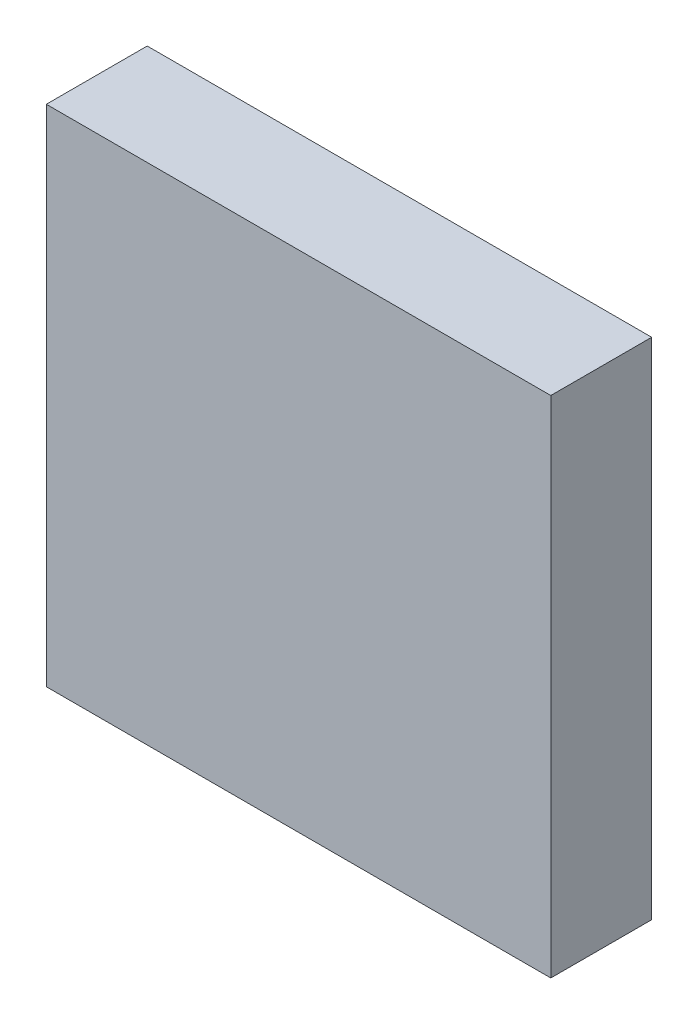
ISO-10303-21;
HEADER;
FILE_DESCRIPTION(('STEP AP214'),'2;1');
FILE_NAME('part.step','',(''),(''),'','','');
FILE_SCHEMA(('AUTOMOTIVE_DESIGN { 1 0 10303 214 1 1 1 1 }'));
ENDSEC;
DATA;
#1=APPLICATION_CONTEXT('core data for automotive mechanical design processes');
#2=APPLICATION_PROTOCOL_DEFINITION('international standard','automotive_design',2000,#1);
#3=PRODUCT_CONTEXT('',#1,'mechanical');
#4=PRODUCT('Part','Part','',(#3));
#5=PRODUCT_RELATED_PRODUCT_CATEGORY('part','',(#4));
#6=PRODUCT_DEFINITION_FORMATION('','',#4);
#7=PRODUCT_DEFINITION_CONTEXT('part definition',#1,'design');
#8=PRODUCT_DEFINITION('design','',#6,#7);
#9=PRODUCT_DEFINITION_SHAPE('','',#8);
#10=(LENGTH_UNIT() NAMED_UNIT(*) SI_UNIT(.MILLI.,.METRE.));
#11=(NAMED_UNIT(*) PLANE_ANGLE_UNIT() SI_UNIT($,.RADIAN.));
#12=(NAMED_UNIT(*) SI_UNIT($,.STERADIAN.) SOLID_ANGLE_UNIT());
#13=UNCERTAINTY_MEASURE_WITH_UNIT(LENGTH_MEASURE(1.E-05),#10,'distance_accuracy_value','');
#14=(GEOMETRIC_REPRESENTATION_CONTEXT(3) GLOBAL_UNCERTAINTY_ASSIGNED_CONTEXT((#13)) GLOBAL_UNIT_ASSIGNED_CONTEXT((#10,
#11,#12)) REPRESENTATION_CONTEXT('',''));
#15=CARTESIAN_POINT('',(0.,0.,0.));
#16=DIRECTION('',(0.,0.,1.));
#17=DIRECTION('',(1.,0.,0.));
#18=AXIS2_PLACEMENT_3D('',#15,#16,#17);
#19=CARTESIAN_POINT('',(466.617543457686,129.384302534264,10.));
#20=DIRECTION('',(0.,1.,0.));
#21=DIRECTION('',(0.,0.,1.));
#22=AXIS2_PLACEMENT_3D('',#19,#20,#21);
#23=PLANE('',#22);
#24=DIRECTION('',(1.,0.,0.));
#25=VECTOR('',#24,1.);
#26=CARTESIAN_POINT('',(466.617543457686,129.384302534264,0.));
#27=LINE('',#26,#25);
#28=CARTESIAN_POINT('',(416.617543457686,129.384302534264,0.));
#29=VERTEX_POINT('',#28);
#30=CARTESIAN_POINT('',(466.617543457686,129.384302534264,0.));
#31=VERTEX_POINT('',#30);
#32=EDGE_CURVE('E91',#29,#31,#27,.T.);
#33=ORIENTED_EDGE('',*,*,#32,.T.);
#34=DIRECTION('',(0.,0.,-1.));
#35=VECTOR('',#34,1.);
#36=CARTESIAN_POINT('',(466.617543457686,129.384302534264,10.));
#37=LINE('',#36,#35);
#38=CARTESIAN_POINT('',(466.617543457686,129.384302534264,10.));
#39=VERTEX_POINT('',#38);
#40=EDGE_CURVE('E45',#39,#31,#37,.T.);
#41=ORIENTED_EDGE('',*,*,#40,.F.);
#42=DIRECTION('',(1.,0.,0.));
#43=VECTOR('',#42,1.);
#44=CARTESIAN_POINT('',(466.617543457686,129.384302534264,10.));
#45=LINE('',#44,#43);
#46=CARTESIAN_POINT('',(416.617543457686,129.384302534264,10.));
#47=VERTEX_POINT('',#46);
#48=EDGE_CURVE('E84',#47,#39,#45,.T.);
#49=ORIENTED_EDGE('',*,*,#48,.F.);
#50=DIRECTION('',(0.,0.,-1.));
#51=VECTOR('',#50,1.);
#52=CARTESIAN_POINT('',(416.617543457686,129.384302534264,10.));
#53=LINE('',#52,#51);
#54=EDGE_CURVE('E11',#47,#29,#53,.T.);
#55=ORIENTED_EDGE('',*,*,#54,.T.);
#56=EDGE_LOOP('',(#33,#41,#49,#55));
#57=FACE_BOUND('',#56,.T.);
#58=ADVANCED_FACE('F37',(#57),#23,.F.);
#59=CARTESIAN_POINT('',(466.617543457686,179.384302534264,10.));
#60=DIRECTION('',(-1.,0.,0.));
#61=DIRECTION('',(0.,0.,1.));
#62=AXIS2_PLACEMENT_3D('',#59,#60,#61);
#63=PLANE('',#62);
#64=DIRECTION('',(0.,1.,0.));
#65=VECTOR('',#64,1.);
#66=CARTESIAN_POINT('',(466.617543457686,179.384302534264,0.));
#67=LINE('',#66,#65);
#68=CARTESIAN_POINT('',(466.617543457686,179.384302534264,0.));
#69=VERTEX_POINT('',#68);
#70=EDGE_CURVE('E71',#31,#69,#67,.T.);
#71=ORIENTED_EDGE('',*,*,#70,.T.);
#72=DIRECTION('',(0.,0.,-1.));
#73=VECTOR('',#72,1.);
#74=CARTESIAN_POINT('',(466.617543457686,179.384302534264,10.));
#75=LINE('',#74,#73);
#76=CARTESIAN_POINT('',(466.617543457686,179.384302534264,10.));
#77=VERTEX_POINT('',#76);
#78=EDGE_CURVE('E92',#77,#69,#75,.T.);
#79=ORIENTED_EDGE('',*,*,#78,.F.);
#80=DIRECTION('',(0.,1.,0.));
#81=VECTOR('',#80,1.);
#82=CARTESIAN_POINT('',(466.617543457686,179.384302534264,10.));
#83=LINE('',#82,#81);
#84=EDGE_CURVE('E88',#39,#77,#83,.T.);
#85=ORIENTED_EDGE('',*,*,#84,.F.);
#86=ORIENTED_EDGE('',*,*,#40,.T.);
#87=EDGE_LOOP('',(#71,#79,#85,#86));
#88=FACE_BOUND('',#87,.T.);
#89=ADVANCED_FACE('F93',(#88),#63,.F.);
#90=CARTESIAN_POINT('',(416.617543457686,179.384302534264,10.));
#91=DIRECTION('',(0.,-1.,0.));
#92=DIRECTION('',(0.,0.,-1.));
#93=AXIS2_PLACEMENT_3D('',#90,#91,#92);
#94=PLANE('',#93);
#95=DIRECTION('',(-1.,0.,0.));
#96=VECTOR('',#95,1.);
#97=CARTESIAN_POINT('',(416.617543457686,179.384302534264,0.));
#98=LINE('',#97,#96);
#99=CARTESIAN_POINT('',(416.617543457686,179.384302534264,0.));
#100=VERTEX_POINT('',#99);
#101=EDGE_CURVE('E78',#69,#100,#98,.T.);
#102=ORIENTED_EDGE('',*,*,#101,.T.);
#103=DIRECTION('',(0.,0.,-1.));
#104=VECTOR('',#103,1.);
#105=CARTESIAN_POINT('',(416.617543457686,179.384302534264,10.));
#106=LINE('',#105,#104);
#107=CARTESIAN_POINT('',(416.617543457686,179.384302534264,10.));
#108=VERTEX_POINT('',#107);
#109=EDGE_CURVE('E97',#108,#100,#106,.T.);
#110=ORIENTED_EDGE('',*,*,#109,.F.);
#111=DIRECTION('',(-1.,0.,0.));
#112=VECTOR('',#111,1.);
#113=CARTESIAN_POINT('',(416.617543457686,179.384302534264,10.));
#114=LINE('',#113,#112);
#115=EDGE_CURVE('E95',#77,#108,#114,.T.);
#116=ORIENTED_EDGE('',*,*,#115,.F.);
#117=ORIENTED_EDGE('',*,*,#78,.T.);
#118=EDGE_LOOP('',(#102,#110,#116,#117));
#119=FACE_BOUND('',#118,.T.);
#120=ADVANCED_FACE('F107',(#119),#94,.F.);
#121=CARTESIAN_POINT('',(416.617543457686,154.384302534264,10.));
#122=DIRECTION('',(1.,0.,0.));
#123=DIRECTION('',(0.,0.,-1.));
#124=AXIS2_PLACEMENT_3D('',#121,#122,#123);
#125=PLANE('',#124);
#126=DIRECTION('',(0.,-1.,0.));
#127=VECTOR('',#126,1.);
#128=CARTESIAN_POINT('',(416.617543457686,154.384302534264,0.));
#129=LINE('',#128,#127);
#130=EDGE_CURVE('E104',#100,#29,#129,.T.);
#131=ORIENTED_EDGE('',*,*,#130,.T.);
#132=ORIENTED_EDGE('',*,*,#54,.F.);
#133=DIRECTION('',(0.,-1.,0.));
#134=VECTOR('',#133,1.);
#135=CARTESIAN_POINT('',(416.617543457686,129.384302534264,10.));
#136=LINE('',#135,#134);
#137=EDGE_CURVE('E53',#108,#47,#136,.T.);
#138=ORIENTED_EDGE('',*,*,#137,.F.);
#139=ORIENTED_EDGE('',*,*,#109,.T.);
#140=EDGE_LOOP('',(#131,#132,#138,#139));
#141=FACE_BOUND('',#140,.T.);
#142=ADVANCED_FACE('F111',(#141),#125,.F.);
#143=CARTESIAN_POINT('',(0.,0.,10.));
#144=DIRECTION('',(0.,0.,-1.));
#145=DIRECTION('',(-1.,0.,0.));
#146=AXIS2_PLACEMENT_3D('',#143,#144,#145);
#147=PLANE('',#146);
#148=ORIENTED_EDGE('',*,*,#137,.T.);
#149=ORIENTED_EDGE('',*,*,#48,.T.);
#150=ORIENTED_EDGE('',*,*,#84,.T.);
#151=ORIENTED_EDGE('',*,*,#115,.T.);
#152=EDGE_LOOP('',(#148,#149,#150,#151));
#153=FACE_BOUND('',#152,.T.);
#154=ADVANCED_FACE('F86',(#153),#147,.F.);
#155=CARTESIAN_POINT('',(0.,0.,0.));
#156=DIRECTION('',(0.,0.,-1.));
#157=DIRECTION('',(-1.,0.,0.));
#158=AXIS2_PLACEMENT_3D('',#155,#156,#157);
#159=PLANE('',#158);
#160=ORIENTED_EDGE('',*,*,#32,.F.);
#161=ORIENTED_EDGE('',*,*,#130,.F.);
#162=ORIENTED_EDGE('',*,*,#101,.F.);
#163=ORIENTED_EDGE('',*,*,#70,.F.);
#164=EDGE_LOOP('',(#160,#161,#162,#163));
#165=FACE_BOUND('',#164,.T.);
#166=ADVANCED_FACE('F110',(#165),#159,.T.);
#167=CLOSED_SHELL('',(#58,#89,#120,#142,#154,#166));
#168=MANIFOLD_SOLID_BREP('B2',#167);
#169=ADVANCED_BREP_SHAPE_REPRESENTATION('',(#18,#168),#14);
#170=SHAPE_DEFINITION_REPRESENTATION(#9,#169);
ENDSEC;
END-ISO-10303-21;
